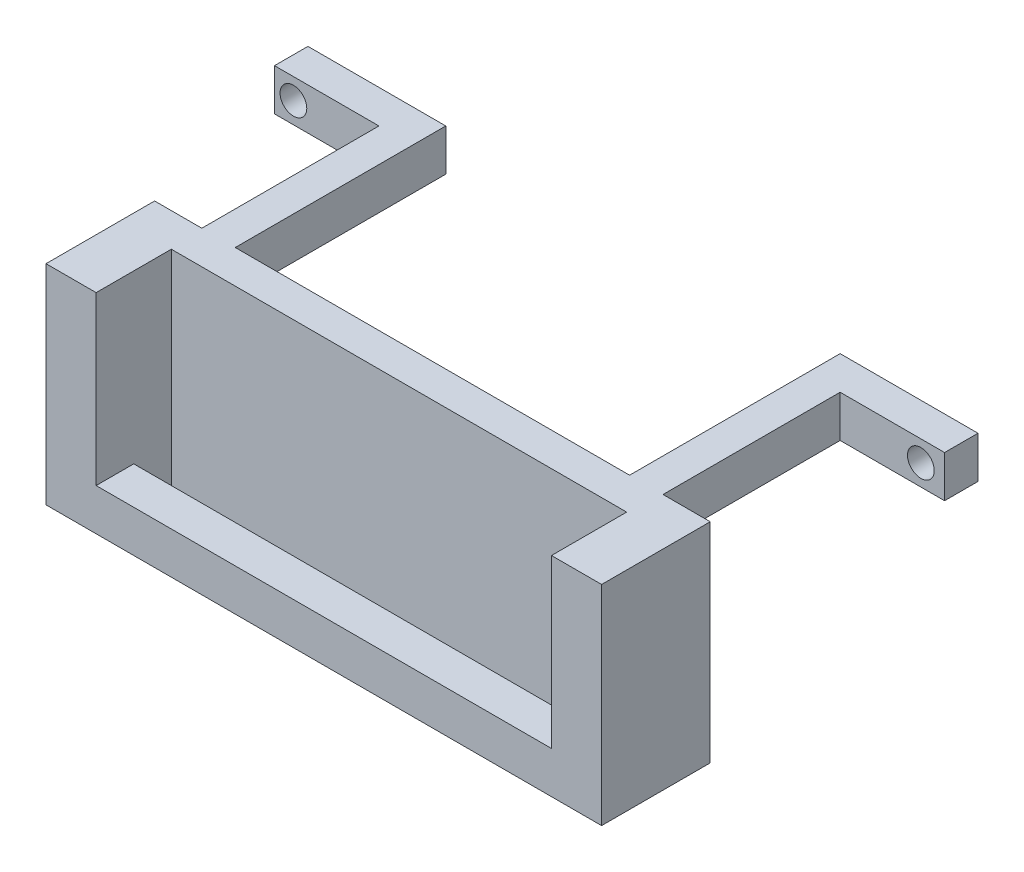
ISO-10303-21;
HEADER;
FILE_DESCRIPTION(('STEP AP214'),'2;1');
FILE_NAME('part.step','',(''),(''),'','','');
FILE_SCHEMA(('AUTOMOTIVE_DESIGN { 1 0 10303 214 1 1 1 1 }'));
ENDSEC;
DATA;
#1=APPLICATION_CONTEXT('core data for automotive mechanical design processes');
#2=APPLICATION_PROTOCOL_DEFINITION('international standard','automotive_design',2000,#1);
#3=PRODUCT_CONTEXT('',#1,'mechanical');
#4=PRODUCT('Part','Part','',(#3));
#5=PRODUCT_RELATED_PRODUCT_CATEGORY('part','',(#4));
#6=PRODUCT_DEFINITION_FORMATION('','',#4);
#7=PRODUCT_DEFINITION_CONTEXT('part definition',#1,'design');
#8=PRODUCT_DEFINITION('design','',#6,#7);
#9=PRODUCT_DEFINITION_SHAPE('','',#8);
#10=(LENGTH_UNIT() NAMED_UNIT(*) SI_UNIT(.MILLI.,.METRE.));
#11=(NAMED_UNIT(*) PLANE_ANGLE_UNIT() SI_UNIT($,.RADIAN.));
#12=(NAMED_UNIT(*) SI_UNIT($,.STERADIAN.) SOLID_ANGLE_UNIT());
#13=UNCERTAINTY_MEASURE_WITH_UNIT(LENGTH_MEASURE(1.E-05),#10,'distance_accuracy_value','');
#14=(GEOMETRIC_REPRESENTATION_CONTEXT(3) GLOBAL_UNCERTAINTY_ASSIGNED_CONTEXT((#13)) GLOBAL_UNIT_ASSIGNED_CONTEXT((#10,
#11,#12)) REPRESENTATION_CONTEXT('',''));
#15=CARTESIAN_POINT('',(0.,0.,0.));
#16=DIRECTION('',(0.,0.,1.));
#17=DIRECTION('',(1.,0.,0.));
#18=AXIS2_PLACEMENT_3D('',#15,#16,#17);
#19=CARTESIAN_POINT('',(-66.582634730539,-10.5311377245509,19.1));
#20=DIRECTION('',(0.,-1.,0.));
#21=DIRECTION('',(1.,0.,0.));
#22=AXIS2_PLACEMENT_3D('',#19,#20,#21);
#23=PLANE('',#22);
#24=DIRECTION('',(1.,0.,0.));
#25=VECTOR('',#24,1.);
#26=CARTESIAN_POINT('',(-94.8326347305389,-10.5311377245509,25.2));
#27=LINE('',#26,#25);
#28=CARTESIAN_POINT('',(-99.8326347305389,-10.5311377245509,25.2));
#29=VERTEX_POINT('',#28);
#30=CARTESIAN_POINT('',(-33.3326347305389,-10.5311377245509,25.2));
#31=VERTEX_POINT('',#30);
#32=EDGE_CURVE('E11',#29,#31,#27,.T.);
#33=ORIENTED_EDGE('',*,*,#32,.T.);
#34=DIRECTION('',(0.,0.,-1.));
#35=VECTOR('',#34,1.);
#36=CARTESIAN_POINT('',(-33.3326347305389,-10.5311377245509,38.2));
#37=LINE('',#36,#35);
#38=CARTESIAN_POINT('',(-33.3326347305389,-10.5311377245509,38.2));
#39=VERTEX_POINT('',#38);
#40=EDGE_CURVE('E24',#39,#31,#37,.T.);
#41=ORIENTED_EDGE('',*,*,#40,.F.);
#42=DIRECTION('',(1.,0.,0.));
#43=VECTOR('',#42,1.);
#44=CARTESIAN_POINT('',(-39.3326347305389,-10.5311377245509,38.2));
#45=LINE('',#44,#43);
#46=CARTESIAN_POINT('',(-99.8326347305389,-10.5311377245509,38.2));
#47=VERTEX_POINT('',#46);
#48=EDGE_CURVE('E452',#47,#39,#45,.T.);
#49=ORIENTED_EDGE('',*,*,#48,.F.);
#50=DIRECTION('',(0.,0.,1.));
#51=VECTOR('',#50,1.);
#52=CARTESIAN_POINT('',(-99.8326347305389,-10.5311377245509,25.2));
#53=LINE('',#52,#51);
#54=EDGE_CURVE('E449',#29,#47,#53,.T.);
#55=ORIENTED_EDGE('',*,*,#54,.F.);
#56=EDGE_LOOP('',(#33,#41,#49,#55));
#57=FACE_BOUND('',#56,.T.);
#58=DIRECTION('',(0.,0.,-1.));
#59=VECTOR('',#58,1.);
#60=CARTESIAN_POINT('',(-93.8326347305389,-10.5311377245509,19.1));
#61=LINE('',#60,#59);
#62=CARTESIAN_POINT('',(-93.8326347305389,-10.5311377245509,33.7));
#63=VERTEX_POINT('',#62);
#64=CARTESIAN_POINT('',(-93.8326347305389,-10.5311377245509,29.2));
#65=VERTEX_POINT('',#64);
#66=EDGE_CURVE('E446',#63,#65,#61,.T.);
#67=ORIENTED_EDGE('',*,*,#66,.F.);
#68=DIRECTION('',(1.,0.,0.));
#69=VECTOR('',#68,1.);
#70=CARTESIAN_POINT('',(-66.582634730539,-10.5311377245509,33.7));
#71=LINE('',#70,#69);
#72=CARTESIAN_POINT('',(-39.3326347305389,-10.5311377245509,33.7));
#73=VERTEX_POINT('',#72);
#74=EDGE_CURVE('E444',#63,#73,#71,.T.);
#75=ORIENTED_EDGE('',*,*,#74,.T.);
#76=DIRECTION('',(0.,0.,1.));
#77=VECTOR('',#76,1.);
#78=CARTESIAN_POINT('',(-39.3326347305389,-10.5311377245509,19.1));
#79=LINE('',#78,#77);
#80=CARTESIAN_POINT('',(-39.3326347305389,-10.5311377245509,29.2));
#81=VERTEX_POINT('',#80);
#82=EDGE_CURVE('E441',#81,#73,#79,.T.);
#83=ORIENTED_EDGE('',*,*,#82,.F.);
#84=DIRECTION('',(-1.,0.,0.));
#85=VECTOR('',#84,1.);
#86=CARTESIAN_POINT('',(-66.582634730539,-10.5311377245509,29.2));
#87=LINE('',#86,#85);
#88=EDGE_CURVE('E439',#81,#65,#87,.T.);
#89=ORIENTED_EDGE('',*,*,#88,.T.);
#90=EDGE_LOOP('',(#67,#75,#83,#89));
#91=FACE_BOUND('',#90,.T.);
#92=ADVANCED_FACE('F17',(#57,#91),#23,.T.);
#93=CARTESIAN_POINT('',(-39.3326347305389,14.4688622754491,35.2));
#94=DIRECTION('',(1.,0.,0.));
#95=DIRECTION('',(0.,0.,-1.));
#96=AXIS2_PLACEMENT_3D('',#93,#94,#95);
#97=PLANE('',#96);
#98=DIRECTION('',(0.,0.,-1.));
#99=VECTOR('',#98,1.);
#100=CARTESIAN_POINT('',(-39.3326347305389,-5.53113772455093,35.2));
#101=LINE('',#100,#99);
#102=CARTESIAN_POINT('',(-39.3326347305389,-5.53113772455093,38.2));
#103=VERTEX_POINT('',#102);
#104=CARTESIAN_POINT('',(-39.3326347305389,-5.53113772455093,33.7));
#105=VERTEX_POINT('',#104);
#106=EDGE_CURVE('E436',#103,#105,#101,.T.);
#107=ORIENTED_EDGE('',*,*,#106,.F.);
#108=DIRECTION('',(0.,-1.,0.));
#109=VECTOR('',#108,1.);
#110=CARTESIAN_POINT('',(-39.3326347305389,14.4688622754491,38.2));
#111=LINE('',#110,#109);
#112=CARTESIAN_POINT('',(-39.3326347305389,14.4688622754491,38.2));
#113=VERTEX_POINT('',#112);
#114=EDGE_CURVE('E433',#113,#103,#111,.T.);
#115=ORIENTED_EDGE('',*,*,#114,.F.);
#116=DIRECTION('',(0.,0.,-1.));
#117=VECTOR('',#116,1.);
#118=CARTESIAN_POINT('',(-39.3326347305389,14.4688622754491,35.2));
#119=LINE('',#118,#117);
#120=CARTESIAN_POINT('',(-39.3326347305389,14.4688622754491,29.2));
#121=VERTEX_POINT('',#120);
#122=EDGE_CURVE('E431',#113,#121,#119,.T.);
#123=ORIENTED_EDGE('',*,*,#122,.T.);
#124=DIRECTION('',(0.,1.,0.));
#125=VECTOR('',#124,1.);
#126=CARTESIAN_POINT('',(-39.3326347305389,14.4688622754491,29.2));
#127=LINE('',#126,#125);
#128=EDGE_CURVE('E428',#81,#121,#127,.T.);
#129=ORIENTED_EDGE('',*,*,#128,.F.);
#130=ORIENTED_EDGE('',*,*,#82,.T.);
#131=DIRECTION('',(0.,1.,0.));
#132=VECTOR('',#131,1.);
#133=CARTESIAN_POINT('',(-39.3326347305389,-30.531137724551,33.7));
#134=LINE('',#133,#132);
#135=EDGE_CURVE('E426',#73,#105,#134,.T.);
#136=ORIENTED_EDGE('',*,*,#135,.T.);
#137=EDGE_LOOP('',(#107,#115,#123,#129,#130,#136));
#138=FACE_BOUND('',#137,.T.);
#139=ADVANCED_FACE('F515',(#138),#97,.F.);
#140=CARTESIAN_POINT('',(-93.8326347305389,14.4688622754491,35.2));
#141=DIRECTION('',(-1.,0.,0.));
#142=DIRECTION('',(0.,0.,1.));
#143=AXIS2_PLACEMENT_3D('',#140,#141,#142);
#144=PLANE('',#143);
#145=DIRECTION('',(0.,0.,1.));
#146=VECTOR('',#145,1.);
#147=CARTESIAN_POINT('',(-93.8326347305389,-5.53113772455093,35.2));
#148=LINE('',#147,#146);
#149=CARTESIAN_POINT('',(-93.8326347305389,-5.53113772455093,33.7));
#150=VERTEX_POINT('',#149);
#151=CARTESIAN_POINT('',(-93.8326347305389,-5.53113772455093,38.2));
#152=VERTEX_POINT('',#151);
#153=EDGE_CURVE('E423',#150,#152,#148,.T.);
#154=ORIENTED_EDGE('',*,*,#153,.F.);
#155=DIRECTION('',(0.,1.,0.));
#156=VECTOR('',#155,1.);
#157=CARTESIAN_POINT('',(-93.8326347305389,-30.531137724551,33.7));
#158=LINE('',#157,#156);
#159=EDGE_CURVE('E420',#63,#150,#158,.T.);
#160=ORIENTED_EDGE('',*,*,#159,.F.);
#161=ORIENTED_EDGE('',*,*,#66,.T.);
#162=DIRECTION('',(0.,-1.,0.));
#163=VECTOR('',#162,1.);
#164=CARTESIAN_POINT('',(-93.8326347305389,14.4688622754491,29.2));
#165=LINE('',#164,#163);
#166=CARTESIAN_POINT('',(-93.8326347305389,14.4688622754491,29.2));
#167=VERTEX_POINT('',#166);
#168=EDGE_CURVE('E417',#167,#65,#165,.T.);
#169=ORIENTED_EDGE('',*,*,#168,.F.);
#170=DIRECTION('',(0.,0.,-1.));
#171=VECTOR('',#170,1.);
#172=CARTESIAN_POINT('',(-93.8326347305389,14.4688622754491,35.2));
#173=LINE('',#172,#171);
#174=CARTESIAN_POINT('',(-93.8326347305389,14.4688622754491,38.2));
#175=VERTEX_POINT('',#174);
#176=EDGE_CURVE('E414',#175,#167,#173,.T.);
#177=ORIENTED_EDGE('',*,*,#176,.F.);
#178=DIRECTION('',(0.,1.,0.));
#179=VECTOR('',#178,1.);
#180=CARTESIAN_POINT('',(-93.8326347305389,14.4688622754491,38.2));
#181=LINE('',#180,#179);
#182=EDGE_CURVE('E411',#152,#175,#181,.T.);
#183=ORIENTED_EDGE('',*,*,#182,.F.);
#184=EDGE_LOOP('',(#154,#160,#161,#169,#177,#183));
#185=FACE_BOUND('',#184,.T.);
#186=ADVANCED_FACE('F521',(#185),#144,.F.);
#187=CARTESIAN_POINT('',(0.,0.,29.2));
#188=DIRECTION('',(0.,0.,1.));
#189=DIRECTION('',(1.,0.,0.));
#190=AXIS2_PLACEMENT_3D('',#187,#188,#189);
#191=PLANE('',#190);
#192=ORIENTED_EDGE('',*,*,#168,.T.);
#193=ORIENTED_EDGE('',*,*,#88,.F.);
#194=ORIENTED_EDGE('',*,*,#128,.T.);
#195=DIRECTION('',(-1.,0.,0.));
#196=VECTOR('',#195,1.);
#197=CARTESIAN_POINT('',(-93.8326347305389,14.4688622754491,29.2));
#198=LINE('',#197,#196);
#199=EDGE_CURVE('E406',#121,#167,#198,.T.);
#200=ORIENTED_EDGE('',*,*,#199,.T.);
#201=EDGE_LOOP('',(#192,#193,#194,#200));
#202=FACE_BOUND('',#201,.T.);
#203=ADVANCED_FACE('F518',(#202),#191,.T.);
#204=CARTESIAN_POINT('',(-91.6826347305389,9.46886227544907,26.2));
#205=DIRECTION('',(0.,1.,0.));
#206=DIRECTION('',(0.,0.,1.));
#207=AXIS2_PLACEMENT_3D('',#204,#205,#206);
#208=PLANE('',#207);
#209=DIRECTION('',(0.,0.,-1.));
#210=VECTOR('',#209,1.);
#211=CARTESIAN_POINT('',(-38.9826347305389,9.46886227544905,25.2));
#212=LINE('',#211,#210);
#213=CARTESIAN_POINT('',(-38.9826347305389,9.46886227544907,25.2));
#214=VERTEX_POINT('',#213);
#215=CARTESIAN_POINT('',(-38.9826347305389,9.46886227544905,4.));
#216=VERTEX_POINT('',#215);
#217=EDGE_CURVE('E401',#214,#216,#212,.T.);
#218=ORIENTED_EDGE('',*,*,#217,.F.);
#219=DIRECTION('',(1.,0.,0.));
#220=VECTOR('',#219,1.);
#221=CARTESIAN_POINT('',(-94.8326347305389,9.46886227544907,25.2));
#222=LINE('',#221,#220);
#223=CARTESIAN_POINT('',(-42.9826347305389,9.46886227544907,25.2));
#224=VERTEX_POINT('',#223);
#225=EDGE_CURVE('E396',#224,#214,#222,.T.);
#226=ORIENTED_EDGE('',*,*,#225,.F.);
#227=DIRECTION('',(0.,0.,1.));
#228=VECTOR('',#227,1.);
#229=CARTESIAN_POINT('',(-42.9826347305389,9.46886227544907,0.));
#230=LINE('',#229,#228);
#231=CARTESIAN_POINT('',(-42.9826347305389,9.46886227544907,0.));
#232=VERTEX_POINT('',#231);
#233=EDGE_CURVE('E393',#232,#224,#230,.T.);
#234=ORIENTED_EDGE('',*,*,#233,.F.);
#235=DIRECTION('',(1.,0.,0.));
#236=VECTOR('',#235,1.);
#237=CARTESIAN_POINT('',(-91.6826347305389,9.46886227544907,0.));
#238=LINE('',#237,#236);
#239=CARTESIAN_POINT('',(-26.4826347305389,9.46886227544905,0.));
#240=VERTEX_POINT('',#239);
#241=EDGE_CURVE('E390',#232,#240,#238,.T.);
#242=ORIENTED_EDGE('',*,*,#241,.T.);
#243=DIRECTION('',(0.,0.,-1.));
#244=VECTOR('',#243,1.);
#245=CARTESIAN_POINT('',(-26.4826347305389,9.46886227544905,2.));
#246=LINE('',#245,#244);
#247=CARTESIAN_POINT('',(-26.4826347305389,9.46886227544905,4.));
#248=VERTEX_POINT('',#247);
#249=EDGE_CURVE('E387',#248,#240,#246,.T.);
#250=ORIENTED_EDGE('',*,*,#249,.F.);
#251=DIRECTION('',(1.,0.,0.));
#252=VECTOR('',#251,1.);
#253=CARTESIAN_POINT('',(-39.9826347305389,9.46886227544905,4.));
#254=LINE('',#253,#252);
#255=EDGE_CURVE('E384',#216,#248,#254,.T.);
#256=ORIENTED_EDGE('',*,*,#255,.F.);
#257=EDGE_LOOP('',(#218,#226,#234,#242,#250,#256));
#258=FACE_BOUND('',#257,.T.);
#259=ADVANCED_FACE('F494',(#258),#208,.F.);
#260=CARTESIAN_POINT('',(0.,0.,0.));
#261=DIRECTION('',(0.,0.,1.));
#262=DIRECTION('',(1.,0.,0.));
#263=AXIS2_PLACEMENT_3D('',#260,#261,#262);
#264=PLANE('',#263);
#265=CARTESIAN_POINT('',(-29.3190241396104,11.9688622754491,0.));
#266=DIRECTION('',(0.,0.,1.));
#267=DIRECTION('',(1.,0.,0.));
#268=AXIS2_PLACEMENT_3D('',#265,#266,#267);
#269=CIRCLE('',#268,1.6);
#270=CARTESIAN_POINT('',(-27.7190241396104,11.9688622754491,0.));
#271=VERTEX_POINT('',#270);
#272=EDGE_CURVE('E381',#271,#271,#269,.T.);
#273=ORIENTED_EDGE('',*,*,#272,.T.);
#274=EDGE_LOOP('',(#273));
#275=FACE_BOUND('',#274,.T.);
#276=DIRECTION('',(0.,-1.,0.));
#277=VECTOR('',#276,1.);
#278=CARTESIAN_POINT('',(-42.9826347305389,14.4688622754491,0.));
#279=LINE('',#278,#277);
#280=CARTESIAN_POINT('',(-42.9826347305389,14.4688622754491,0.));
#281=VERTEX_POINT('',#280);
#282=EDGE_CURVE('E378',#281,#232,#279,.T.);
#283=ORIENTED_EDGE('',*,*,#282,.F.);
#284=DIRECTION('',(-1.,0.,0.));
#285=VECTOR('',#284,1.);
#286=CARTESIAN_POINT('',(-91.6826347305389,14.4688622754491,0.));
#287=LINE('',#286,#285);
#288=CARTESIAN_POINT('',(-26.4826347305389,14.4688622754491,0.));
#289=VERTEX_POINT('',#288);
#290=EDGE_CURVE('E375',#289,#281,#287,.T.);
#291=ORIENTED_EDGE('',*,*,#290,.F.);
#292=DIRECTION('',(0.,1.,0.));
#293=VECTOR('',#292,1.);
#294=CARTESIAN_POINT('',(-26.4826347305389,14.4688622754491,0.));
#295=LINE('',#294,#293);
#296=EDGE_CURVE('E372',#240,#289,#295,.T.);
#297=ORIENTED_EDGE('',*,*,#296,.F.);
#298=ORIENTED_EDGE('',*,*,#241,.F.);
#299=EDGE_LOOP('',(#283,#291,#297,#298));
#300=FACE_BOUND('',#299,.T.);
#301=ADVANCED_FACE('F497',(#275,#300),#264,.F.);
#302=CARTESIAN_POINT('',(-96.6826347305389,14.4688622754491,2.));
#303=DIRECTION('',(0.,-1.,0.));
#304=DIRECTION('',(0.,0.,-1.));
#305=AXIS2_PLACEMENT_3D('',#302,#303,#304);
#306=PLANE('',#305);
#307=DIRECTION('',(-1.,0.,0.));
#308=VECTOR('',#307,1.);
#309=CARTESIAN_POINT('',(-38.3326347305389,14.4688622754491,25.2));
#310=LINE('',#309,#308);
#311=CARTESIAN_POINT('',(-33.3326347305389,14.4688622754491,25.2));
#312=VERTEX_POINT('',#311);
#313=CARTESIAN_POINT('',(-38.9826347305389,14.4688622754491,25.2));
#314=VERTEX_POINT('',#313);
#315=EDGE_CURVE('E370',#312,#314,#310,.T.);
#316=ORIENTED_EDGE('',*,*,#315,.T.);
#317=DIRECTION('',(0.,0.,1.));
#318=VECTOR('',#317,1.);
#319=CARTESIAN_POINT('',(-38.9826347305389,14.4688622754491,25.2));
#320=LINE('',#319,#318);
#321=CARTESIAN_POINT('',(-38.9826347305389,14.4688622754491,4.));
#322=VERTEX_POINT('',#321);
#323=EDGE_CURVE('E367',#322,#314,#320,.T.);
#324=ORIENTED_EDGE('',*,*,#323,.F.);
#325=DIRECTION('',(-1.,0.,0.));
#326=VECTOR('',#325,1.);
#327=CARTESIAN_POINT('',(-39.9826347305389,14.4688622754491,4.));
#328=LINE('',#327,#326);
#329=CARTESIAN_POINT('',(-26.4826347305389,14.4688622754491,4.));
#330=VERTEX_POINT('',#329);
#331=EDGE_CURVE('E364',#330,#322,#328,.T.);
#332=ORIENTED_EDGE('',*,*,#331,.F.);
#333=DIRECTION('',(0.,0.,1.));
#334=VECTOR('',#333,1.);
#335=CARTESIAN_POINT('',(-26.4826347305389,14.4688622754491,2.));
#336=LINE('',#335,#334);
#337=EDGE_CURVE('E361',#289,#330,#336,.T.);
#338=ORIENTED_EDGE('',*,*,#337,.F.);
#339=ORIENTED_EDGE('',*,*,#290,.T.);
#340=DIRECTION('',(0.,0.,-1.));
#341=VECTOR('',#340,1.);
#342=CARTESIAN_POINT('',(-42.9826347305389,14.4688622754491,0.));
#343=LINE('',#342,#341);
#344=CARTESIAN_POINT('',(-42.9826347305389,14.4688622754491,25.1997835267334));
#345=VERTEX_POINT('',#344);
#346=EDGE_CURVE('E358',#345,#281,#343,.T.);
#347=ORIENTED_EDGE('',*,*,#346,.F.);
#348=DIRECTION('',(-1.,0.,0.));
#349=VECTOR('',#348,1.);
#350=CARTESIAN_POINT('',(-91.6826347305389,14.4688622754491,25.1997835267334));
#351=LINE('',#350,#349);
#352=CARTESIAN_POINT('',(-90.1826347305389,14.4688622754491,25.1997835267334));
#353=VERTEX_POINT('',#352);
#354=EDGE_CURVE('E356',#345,#353,#351,.T.);
#355=ORIENTED_EDGE('',*,*,#354,.T.);
#356=DIRECTION('',(0.,0.,1.));
#357=VECTOR('',#356,1.);
#358=CARTESIAN_POINT('',(-90.1826347305389,14.4688622754491,25.1997835267334));
#359=LINE('',#358,#357);
#360=CARTESIAN_POINT('',(-90.1826347305389,14.4688622754491,0.));
#361=VERTEX_POINT('',#360);
#362=EDGE_CURVE('E353',#361,#353,#359,.T.);
#363=ORIENTED_EDGE('',*,*,#362,.F.);
#364=DIRECTION('',(1.,0.,0.));
#365=VECTOR('',#364,1.);
#366=CARTESIAN_POINT('',(-96.6826347305389,14.4688622754491,0.));
#367=LINE('',#366,#365);
#368=CARTESIAN_POINT('',(-106.682634730539,14.4688622754491,0.));
#369=VERTEX_POINT('',#368);
#370=EDGE_CURVE('E350',#369,#361,#367,.T.);
#371=ORIENTED_EDGE('',*,*,#370,.F.);
#372=DIRECTION('',(0.,0.,-1.));
#373=VECTOR('',#372,1.);
#374=CARTESIAN_POINT('',(-106.682634730539,14.4688622754491,0.));
#375=LINE('',#374,#373);
#376=CARTESIAN_POINT('',(-106.682634730539,14.4688622754491,4.));
#377=VERTEX_POINT('',#376);
#378=EDGE_CURVE('E347',#377,#369,#375,.T.);
#379=ORIENTED_EDGE('',*,*,#378,.F.);
#380=DIRECTION('',(-1.,0.,0.));
#381=VECTOR('',#380,1.);
#382=CARTESIAN_POINT('',(-106.682634730539,14.4688622754491,4.));
#383=LINE('',#382,#381);
#384=CARTESIAN_POINT('',(-94.1826347305389,14.4688622754491,4.));
#385=VERTEX_POINT('',#384);
#386=EDGE_CURVE('E345',#385,#377,#383,.T.);
#387=ORIENTED_EDGE('',*,*,#386,.F.);
#388=DIRECTION('',(0.,0.,-1.));
#389=VECTOR('',#388,1.);
#390=CARTESIAN_POINT('',(-94.1826347305389,14.4688622754491,4.));
#391=LINE('',#390,#389);
#392=CARTESIAN_POINT('',(-94.1826347305389,14.4688622754491,25.2));
#393=VERTEX_POINT('',#392);
#394=EDGE_CURVE('E204',#393,#385,#391,.T.);
#395=ORIENTED_EDGE('',*,*,#394,.F.);
#396=DIRECTION('',(1.,0.,0.));
#397=VECTOR('',#396,1.);
#398=CARTESIAN_POINT('',(-94.8326347305389,14.4688622754491,25.2));
#399=LINE('',#398,#397);
#400=CARTESIAN_POINT('',(-99.8326347305389,14.4688622754491,25.2));
#401=VERTEX_POINT('',#400);
#402=EDGE_CURVE('E341',#401,#393,#399,.T.);
#403=ORIENTED_EDGE('',*,*,#402,.F.);
#404=DIRECTION('',(0.,0.,-1.));
#405=VECTOR('',#404,1.);
#406=CARTESIAN_POINT('',(-99.8326347305389,14.4688622754491,25.2));
#407=LINE('',#406,#405);
#408=CARTESIAN_POINT('',(-99.8326347305389,14.4688622754491,38.2));
#409=VERTEX_POINT('',#408);
#410=EDGE_CURVE('E338',#409,#401,#407,.T.);
#411=ORIENTED_EDGE('',*,*,#410,.F.);
#412=DIRECTION('',(-1.,0.,0.));
#413=VECTOR('',#412,1.);
#414=CARTESIAN_POINT('',(-96.8326347305389,14.4688622754491,38.2));
#415=LINE('',#414,#413);
#416=EDGE_CURVE('E335',#175,#409,#415,.T.);
#417=ORIENTED_EDGE('',*,*,#416,.F.);
#418=ORIENTED_EDGE('',*,*,#176,.T.);
#419=ORIENTED_EDGE('',*,*,#199,.F.);
#420=ORIENTED_EDGE('',*,*,#122,.F.);
#421=DIRECTION('',(-1.,0.,0.));
#422=VECTOR('',#421,1.);
#423=CARTESIAN_POINT('',(-39.3326347305389,14.4688622754491,38.2));
#424=LINE('',#423,#422);
#425=CARTESIAN_POINT('',(-33.3326347305389,14.4688622754491,38.2));
#426=VERTEX_POINT('',#425);
#427=EDGE_CURVE('E332',#426,#113,#424,.T.);
#428=ORIENTED_EDGE('',*,*,#427,.F.);
#429=DIRECTION('',(0.,0.,1.));
#430=VECTOR('',#429,1.);
#431=CARTESIAN_POINT('',(-33.3326347305389,14.4688622754491,38.2));
#432=LINE('',#431,#430);
#433=EDGE_CURVE('E329',#312,#426,#432,.T.);
#434=ORIENTED_EDGE('',*,*,#433,.F.);
#435=EDGE_LOOP('',(#316,#324,#332,#338,#339,#347,#355,#363,#371,#379,#387,#395,#403,#411,#417,
#418,#419,#420,#428,#434));
#436=FACE_BOUND('',#435,.T.);
#437=ADVANCED_FACE('F473',(#436),#306,.F.);
#438=CARTESIAN_POINT('',(-96.6826347305389,14.4688622754491,0.));
#439=DIRECTION('',(0.,0.,1.));
#440=DIRECTION('',(1.,0.,0.));
#441=AXIS2_PLACEMENT_3D('',#438,#439,#440);
#442=PLANE('',#441);
#443=CARTESIAN_POINT('',(-104.419830921664,11.9688622754491,0.));
#444=DIRECTION('',(0.,0.,1.));
#445=DIRECTION('',(1.,0.,0.));
#446=AXIS2_PLACEMENT_3D('',#443,#444,#445);
#447=CIRCLE('',#446,1.6);
#448=CARTESIAN_POINT('',(-102.819830921664,11.9688622754491,0.));
#449=VERTEX_POINT('',#448);
#450=EDGE_CURVE('E326',#449,#449,#447,.T.);
#451=ORIENTED_EDGE('',*,*,#450,.T.);
#452=EDGE_LOOP('',(#451));
#453=FACE_BOUND('',#452,.T.);
#454=ORIENTED_EDGE('',*,*,#370,.T.);
#455=DIRECTION('',(0.,1.,0.));
#456=VECTOR('',#455,1.);
#457=CARTESIAN_POINT('',(-90.1826347305389,9.46886227544907,0.));
#458=LINE('',#457,#456);
#459=CARTESIAN_POINT('',(-90.1826347305389,9.46886227544907,0.));
#460=VERTEX_POINT('',#459);
#461=EDGE_CURVE('E323',#460,#361,#458,.T.);
#462=ORIENTED_EDGE('',*,*,#461,.F.);
#463=CARTESIAN_POINT('',(-94.6826347305389,9.46886227544907,0.));
#464=VERTEX_POINT('',#463);
#465=EDGE_CURVE('E322',#464,#460,#238,.T.);
#466=ORIENTED_EDGE('',*,*,#465,.F.);
#467=DIRECTION('',(0.,-1.,0.));
#468=VECTOR('',#467,1.);
#469=CARTESIAN_POINT('',(-94.6826347305389,14.4688622754491,0.));
#470=LINE('',#469,#468);
#471=CARTESIAN_POINT('',(-94.6826347305389,9.47157193083374,0.));
#472=VERTEX_POINT('',#471);
#473=EDGE_CURVE('E319',#472,#464,#470,.T.);
#474=ORIENTED_EDGE('',*,*,#473,.F.);
#475=DIRECTION('',(1.,0.,0.));
#476=VECTOR('',#475,1.);
#477=CARTESIAN_POINT('',(-96.6826347305389,9.47157193083374,0.));
#478=LINE('',#477,#476);
#479=CARTESIAN_POINT('',(-106.682634730539,9.47157193083374,0.));
#480=VERTEX_POINT('',#479);
#481=EDGE_CURVE('E316',#480,#472,#478,.T.);
#482=ORIENTED_EDGE('',*,*,#481,.F.);
#483=DIRECTION('',(0.,-1.,0.));
#484=VECTOR('',#483,1.);
#485=CARTESIAN_POINT('',(-106.682634730539,14.4688622754491,0.));
#486=LINE('',#485,#484);
#487=EDGE_CURVE('E313',#369,#480,#486,.T.);
#488=ORIENTED_EDGE('',*,*,#487,.F.);
#489=EDGE_LOOP('',(#454,#462,#466,#474,#482,#488));
#490=FACE_BOUND('',#489,.T.);
#491=ADVANCED_FACE('F568',(#453,#490),#442,.F.);
#492=CARTESIAN_POINT('',(-96.6826347305389,9.47157193083374,2.));
#493=DIRECTION('',(0.,1.,0.));
#494=DIRECTION('',(0.,0.,1.));
#495=AXIS2_PLACEMENT_3D('',#492,#493,#494);
#496=PLANE('',#495);
#497=DIRECTION('',(0.,0.,1.));
#498=VECTOR('',#497,1.);
#499=CARTESIAN_POINT('',(-94.6826347305389,9.47157193083374,2.));
#500=LINE('',#499,#498);
#501=CARTESIAN_POINT('',(-94.6826347305389,9.47157193083374,2.));
#502=VERTEX_POINT('',#501);
#503=EDGE_CURVE('E311',#472,#502,#500,.T.);
#504=ORIENTED_EDGE('',*,*,#503,.T.);
#505=DIRECTION('',(1.,0.,0.));
#506=VECTOR('',#505,1.);
#507=CARTESIAN_POINT('',(-96.6826347305389,9.47157193083374,2.));
#508=LINE('',#507,#506);
#509=CARTESIAN_POINT('',(-106.682634730539,9.47157193083374,2.));
#510=VERTEX_POINT('',#509);
#511=EDGE_CURVE('E308',#510,#502,#508,.T.);
#512=ORIENTED_EDGE('',*,*,#511,.F.);
#513=DIRECTION('',(0.,0.,1.));
#514=VECTOR('',#513,1.);
#515=CARTESIAN_POINT('',(-106.682634730539,9.47157193083374,0.));
#516=LINE('',#515,#514);
#517=EDGE_CURVE('E305',#480,#510,#516,.T.);
#518=ORIENTED_EDGE('',*,*,#517,.F.);
#519=ORIENTED_EDGE('',*,*,#481,.T.);
#520=EDGE_LOOP('',(#504,#512,#518,#519));
#521=FACE_BOUND('',#520,.T.);
#522=ADVANCED_FACE('F571',(#521),#496,.F.);
#523=CARTESIAN_POINT('',(-106.682634730539,0.,0.));
#524=DIRECTION('',(-1.,0.,0.));
#525=DIRECTION('',(0.,0.,1.));
#526=AXIS2_PLACEMENT_3D('',#523,#524,#525);
#527=PLANE('',#526);
#528=ORIENTED_EDGE('',*,*,#487,.T.);
#529=ORIENTED_EDGE('',*,*,#517,.T.);
#530=DIRECTION('',(0.,-1.,0.));
#531=VECTOR('',#530,1.);
#532=CARTESIAN_POINT('',(-106.682634730539,14.4688622754491,2.));
#533=LINE('',#532,#531);
#534=CARTESIAN_POINT('',(-106.682634730539,9.46886227544907,2.));
#535=VERTEX_POINT('',#534);
#536=EDGE_CURVE('E303',#510,#535,#533,.T.);
#537=ORIENTED_EDGE('',*,*,#536,.T.);
#538=DIRECTION('',(0.,0.,-1.));
#539=VECTOR('',#538,1.);
#540=CARTESIAN_POINT('',(-106.682634730539,9.46886227544907,4.));
#541=LINE('',#540,#539);
#542=CARTESIAN_POINT('',(-106.682634730539,9.46886227544907,4.));
#543=VERTEX_POINT('',#542);
#544=EDGE_CURVE('E301',#543,#535,#541,.T.);
#545=ORIENTED_EDGE('',*,*,#544,.F.);
#546=DIRECTION('',(0.,-1.,0.));
#547=VECTOR('',#546,1.);
#548=CARTESIAN_POINT('',(-106.682634730539,14.4688622754491,4.));
#549=LINE('',#548,#547);
#550=EDGE_CURVE('E200',#377,#543,#549,.T.);
#551=ORIENTED_EDGE('',*,*,#550,.F.);
#552=ORIENTED_EDGE('',*,*,#378,.T.);
#553=EDGE_LOOP('',(#528,#529,#537,#545,#551,#552));
#554=FACE_BOUND('',#553,.T.);
#555=ADVANCED_FACE('F477',(#554),#527,.T.);
#556=CARTESIAN_POINT('',(-94.6826347305389,0.,0.));
#557=DIRECTION('',(1.,0.,0.));
#558=DIRECTION('',(0.,0.,-1.));
#559=AXIS2_PLACEMENT_3D('',#556,#557,#558);
#560=PLANE('',#559);
#561=DIRECTION('',(0.,1.,0.));
#562=VECTOR('',#561,1.);
#563=CARTESIAN_POINT('',(-94.6826347305389,14.4688622754491,2.));
#564=LINE('',#563,#562);
#565=CARTESIAN_POINT('',(-94.6826347305389,9.46886227544907,2.));
#566=VERTEX_POINT('',#565);
#567=EDGE_CURVE('E297',#566,#502,#564,.T.);
#568=ORIENTED_EDGE('',*,*,#567,.T.);
#569=ORIENTED_EDGE('',*,*,#503,.F.);
#570=ORIENTED_EDGE('',*,*,#473,.T.);
#571=DIRECTION('',(0.,0.,1.));
#572=VECTOR('',#571,1.);
#573=CARTESIAN_POINT('',(-94.6826347305389,9.46886227544907,2.));
#574=LINE('',#573,#572);
#575=EDGE_CURVE('E293',#464,#566,#574,.T.);
#576=ORIENTED_EDGE('',*,*,#575,.T.);
#577=EDGE_LOOP('',(#568,#569,#570,#576));
#578=FACE_BOUND('',#577,.T.);
#579=ADVANCED_FACE('F259',(#578),#560,.F.);
#580=DIRECTION('',(0.,0.,-1.));
#581=VECTOR('',#580,1.);
#582=CARTESIAN_POINT('',(-90.1826347305389,9.46886227544907,25.1997835267334));
#583=LINE('',#582,#581);
#584=CARTESIAN_POINT('',(-90.1826347305389,9.46886227544907,25.2));
#585=VERTEX_POINT('',#584);
#586=EDGE_CURVE('E288',#585,#460,#583,.T.);
#587=ORIENTED_EDGE('',*,*,#586,.F.);
#588=DIRECTION('',(1.,0.,0.));
#589=VECTOR('',#588,1.);
#590=CARTESIAN_POINT('',(-94.8326347305389,9.46886227544907,25.2));
#591=LINE('',#590,#589);
#592=CARTESIAN_POINT('',(-94.1826347305389,9.46886227544907,25.2));
#593=VERTEX_POINT('',#592);
#594=EDGE_CURVE('E186',#593,#585,#591,.T.);
#595=ORIENTED_EDGE('',*,*,#594,.F.);
#596=DIRECTION('',(0.,0.,1.));
#597=VECTOR('',#596,1.);
#598=CARTESIAN_POINT('',(-94.1826347305389,9.46886227544907,4.));
#599=LINE('',#598,#597);
#600=CARTESIAN_POINT('',(-94.1826347305389,9.46886227544907,4.));
#601=VERTEX_POINT('',#600);
#602=EDGE_CURVE('E179',#601,#593,#599,.T.);
#603=ORIENTED_EDGE('',*,*,#602,.F.);
#604=DIRECTION('',(1.,0.,0.));
#605=VECTOR('',#604,1.);
#606=CARTESIAN_POINT('',(-106.682634730539,9.46886227544907,4.));
#607=LINE('',#606,#605);
#608=EDGE_CURVE('E183',#543,#601,#607,.T.);
#609=ORIENTED_EDGE('',*,*,#608,.F.);
#610=ORIENTED_EDGE('',*,*,#544,.T.);
#611=DIRECTION('',(1.,0.,0.));
#612=VECTOR('',#611,1.);
#613=CARTESIAN_POINT('',(-106.682634730539,9.46886227544907,2.));
#614=LINE('',#613,#612);
#615=EDGE_CURVE('E201',#535,#566,#614,.T.);
#616=ORIENTED_EDGE('',*,*,#615,.T.);
#617=ORIENTED_EDGE('',*,*,#575,.F.);
#618=ORIENTED_EDGE('',*,*,#465,.T.);
#619=EDGE_LOOP('',(#587,#595,#603,#609,#610,#616,#617,#618));
#620=FACE_BOUND('',#619,.T.);
#621=ADVANCED_FACE('F181',(#620),#208,.F.);
#622=CARTESIAN_POINT('',(-89.1826347305389,32.4688622754491,25.1997835267334));
#623=DIRECTION('',(0.,0.,1.));
#624=DIRECTION('',(1.,0.,0.));
#625=AXIS2_PLACEMENT_3D('',#622,#623,#624);
#626=PLANE('',#625);
#627=ORIENTED_EDGE('',*,*,#354,.F.);
#628=DIRECTION('',(0.,1.,0.));
#629=VECTOR('',#628,1.);
#630=CARTESIAN_POINT('',(-42.9826347305389,14.4688622754491,25.1997835267334));
#631=LINE('',#630,#629);
#632=EDGE_CURVE('E278',#224,#345,#631,.T.);
#633=ORIENTED_EDGE('',*,*,#632,.F.);
#634=CARTESIAN_POINT('',(-42.9826347305389,9.4688622754491,25.1997835267334));
#635=DIRECTION('',(-1.,0.,0.));
#636=VECTOR('',#635,1.);
#637=LINE('',#634,#636);
#638=EDGE_CURVE('E277',#224,#585,#637,.T.);
#639=ORIENTED_EDGE('',*,*,#638,.T.);
#640=DIRECTION('',(0.,-1.,0.));
#641=VECTOR('',#640,1.);
#642=CARTESIAN_POINT('',(-90.1826347305389,9.46886227544907,25.1997835267334));
#643=LINE('',#642,#641);
#644=EDGE_CURVE('E465',#353,#585,#643,.T.);
#645=ORIENTED_EDGE('',*,*,#644,.F.);
#646=EDGE_LOOP('',(#627,#633,#639,#645));
#647=FACE_BOUND('',#646,.T.);
#648=ADVANCED_FACE('F252',(#647),#626,.F.);
#649=CARTESIAN_POINT('',(-94.8326347305389,14.4688622754491,25.2));
#650=DIRECTION('',(0.,0.,1.));
#651=DIRECTION('',(0.,-1.,0.));
#652=AXIS2_PLACEMENT_3D('',#649,#650,#651);
#653=PLANE('',#652);
#654=ORIENTED_EDGE('',*,*,#32,.F.);
#655=DIRECTION('',(0.,-1.,0.));
#656=VECTOR('',#655,1.);
#657=CARTESIAN_POINT('',(-99.8326347305389,14.4688622754491,25.2));
#658=LINE('',#657,#656);
#659=EDGE_CURVE('E462',#401,#29,#658,.T.);
#660=ORIENTED_EDGE('',*,*,#659,.F.);
#661=ORIENTED_EDGE('',*,*,#402,.T.);
#662=DIRECTION('',(0.,1.,0.));
#663=VECTOR('',#662,1.);
#664=CARTESIAN_POINT('',(-94.1826347305389,14.4688622754491,25.2));
#665=LINE('',#664,#663);
#666=EDGE_CURVE('E232',#593,#393,#665,.T.);
#667=ORIENTED_EDGE('',*,*,#666,.F.);
#668=ORIENTED_EDGE('',*,*,#594,.T.);
#669=ORIENTED_EDGE('',*,*,#638,.F.);
#670=ORIENTED_EDGE('',*,*,#225,.T.);
#671=DIRECTION('',(0.,-1.,0.));
#672=VECTOR('',#671,1.);
#673=CARTESIAN_POINT('',(-38.9826347305389,14.4688622754491,25.2));
#674=LINE('',#673,#672);
#675=EDGE_CURVE('E227',#314,#214,#674,.T.);
#676=ORIENTED_EDGE('',*,*,#675,.F.);
#677=ORIENTED_EDGE('',*,*,#315,.F.);
#678=DIRECTION('',(0.,1.,0.));
#679=VECTOR('',#678,1.);
#680=CARTESIAN_POINT('',(-33.3326347305389,14.4688622754491,25.2));
#681=LINE('',#680,#679);
#682=EDGE_CURVE('E224',#31,#312,#681,.T.);
#683=ORIENTED_EDGE('',*,*,#682,.F.);
#684=EDGE_LOOP('',(#654,#660,#661,#667,#668,#669,#670,#676,#677,#683));
#685=FACE_BOUND('',#684,.T.);
#686=ADVANCED_FACE('F241',(#685),#653,.F.);
#687=CARTESIAN_POINT('',(0.,0.,38.2));
#688=DIRECTION('',(0.,0.,1.));
#689=DIRECTION('',(1.,0.,0.));
#690=AXIS2_PLACEMENT_3D('',#687,#688,#689);
#691=PLANE('',#690);
#692=ORIENTED_EDGE('',*,*,#48,.T.);
#693=DIRECTION('',(0.,-1.,0.));
#694=VECTOR('',#693,1.);
#695=CARTESIAN_POINT('',(-33.3326347305389,14.4688622754491,38.2));
#696=LINE('',#695,#694);
#697=EDGE_CURVE('E221',#426,#39,#696,.T.);
#698=ORIENTED_EDGE('',*,*,#697,.F.);
#699=ORIENTED_EDGE('',*,*,#427,.T.);
#700=ORIENTED_EDGE('',*,*,#114,.T.);
#701=DIRECTION('',(1.,0.,0.));
#702=VECTOR('',#701,1.);
#703=CARTESIAN_POINT('',(-39.3326347305389,-5.53113772455093,38.2));
#704=LINE('',#703,#702);
#705=EDGE_CURVE('E218',#152,#103,#704,.T.);
#706=ORIENTED_EDGE('',*,*,#705,.F.);
#707=ORIENTED_EDGE('',*,*,#182,.T.);
#708=ORIENTED_EDGE('',*,*,#416,.T.);
#709=DIRECTION('',(0.,1.,0.));
#710=VECTOR('',#709,1.);
#711=CARTESIAN_POINT('',(-99.8326347305389,14.4688622754491,38.2));
#712=LINE('',#711,#710);
#713=EDGE_CURVE('E209',#47,#409,#712,.T.);
#714=ORIENTED_EDGE('',*,*,#713,.F.);
#715=EDGE_LOOP('',(#692,#698,#699,#700,#706,#707,#708,#714));
#716=FACE_BOUND('',#715,.T.);
#717=ADVANCED_FACE('F251',(#716),#691,.T.);
#718=CARTESIAN_POINT('',(-99.8326347305389,0.,0.));
#719=DIRECTION('',(-1.,0.,0.));
#720=DIRECTION('',(0.,0.,1.));
#721=AXIS2_PLACEMENT_3D('',#718,#719,#720);
#722=PLANE('',#721);
#723=ORIENTED_EDGE('',*,*,#713,.T.);
#724=ORIENTED_EDGE('',*,*,#410,.T.);
#725=ORIENTED_EDGE('',*,*,#659,.T.);
#726=ORIENTED_EDGE('',*,*,#54,.T.);
#727=EDGE_LOOP('',(#723,#724,#725,#726));
#728=FACE_BOUND('',#727,.T.);
#729=ADVANCED_FACE('F464',(#728),#722,.T.);
#730=CARTESIAN_POINT('',(-33.3326347305389,0.,0.));
#731=DIRECTION('',(1.,0.,0.));
#732=DIRECTION('',(0.,0.,-1.));
#733=AXIS2_PLACEMENT_3D('',#730,#731,#732);
#734=PLANE('',#733);
#735=ORIENTED_EDGE('',*,*,#682,.T.);
#736=ORIENTED_EDGE('',*,*,#433,.T.);
#737=ORIENTED_EDGE('',*,*,#697,.T.);
#738=ORIENTED_EDGE('',*,*,#40,.T.);
#739=EDGE_LOOP('',(#735,#736,#737,#738));
#740=FACE_BOUND('',#739,.T.);
#741=ADVANCED_FACE('F454',(#740),#734,.T.);
#742=CARTESIAN_POINT('',(-26.4826347305389,0.,0.));
#743=DIRECTION('',(1.,0.,0.));
#744=DIRECTION('',(0.,1.,0.));
#745=AXIS2_PLACEMENT_3D('',#742,#743,#744);
#746=PLANE('',#745);
#747=ORIENTED_EDGE('',*,*,#337,.T.);
#748=DIRECTION('',(0.,1.,0.));
#749=VECTOR('',#748,1.);
#750=CARTESIAN_POINT('',(-26.4826347305389,14.4688622754491,4.));
#751=LINE('',#750,#749);
#752=EDGE_CURVE('E205',#248,#330,#751,.T.);
#753=ORIENTED_EDGE('',*,*,#752,.F.);
#754=ORIENTED_EDGE('',*,*,#249,.T.);
#755=ORIENTED_EDGE('',*,*,#296,.T.);
#756=EDGE_LOOP('',(#747,#753,#754,#755));
#757=FACE_BOUND('',#756,.T.);
#758=ADVANCED_FACE('F501',(#757),#746,.T.);
#759=CARTESIAN_POINT('',(0.,0.,2.));
#760=DIRECTION('',(0.,0.,1.));
#761=DIRECTION('',(1.,0.,0.));
#762=AXIS2_PLACEMENT_3D('',#759,#760,#761);
#763=PLANE('',#762);
#764=ORIENTED_EDGE('',*,*,#536,.F.);
#765=ORIENTED_EDGE('',*,*,#511,.T.);
#766=ORIENTED_EDGE('',*,*,#567,.F.);
#767=ORIENTED_EDGE('',*,*,#615,.F.);
#768=EDGE_LOOP('',(#764,#765,#766,#767));
#769=FACE_BOUND('',#768,.T.);
#770=ADVANCED_FACE('F483',(#769),#763,.F.);
#771=CARTESIAN_POINT('',(0.,0.,4.));
#772=DIRECTION('',(0.,0.,1.));
#773=DIRECTION('',(1.,0.,0.));
#774=AXIS2_PLACEMENT_3D('',#771,#772,#773);
#775=PLANE('',#774);
#776=DIRECTION('',(0.,-1.,0.));
#777=VECTOR('',#776,1.);
#778=CARTESIAN_POINT('',(-94.1826347305389,14.4688622754491,4.));
#779=LINE('',#778,#777);
#780=EDGE_CURVE('E197',#385,#601,#779,.T.);
#781=ORIENTED_EDGE('',*,*,#780,.F.);
#782=ORIENTED_EDGE('',*,*,#386,.T.);
#783=ORIENTED_EDGE('',*,*,#550,.T.);
#784=ORIENTED_EDGE('',*,*,#608,.T.);
#785=EDGE_LOOP('',(#781,#782,#783,#784));
#786=FACE_BOUND('',#785,.T.);
#787=CARTESIAN_POINT('',(-104.419830921664,11.9688622754491,4.));
#788=DIRECTION('',(0.,0.,1.));
#789=DIRECTION('',(1.,0.,0.));
#790=AXIS2_PLACEMENT_3D('',#787,#788,#789);
#791=CIRCLE('',#790,1.6);
#792=CARTESIAN_POINT('',(-102.819830921664,11.9688622754491,4.));
#793=VERTEX_POINT('',#792);
#794=EDGE_CURVE('E206',#793,#793,#791,.T.);
#795=ORIENTED_EDGE('',*,*,#794,.F.);
#796=EDGE_LOOP('',(#795));
#797=FACE_BOUND('',#796,.T.);
#798=ADVANCED_FACE('F194',(#786,#797),#775,.T.);
#799=CARTESIAN_POINT('',(0.,0.,4.));
#800=DIRECTION('',(0.,0.,1.));
#801=DIRECTION('',(1.,0.,0.));
#802=AXIS2_PLACEMENT_3D('',#799,#800,#801);
#803=PLANE('',#802);
#804=DIRECTION('',(0.,1.,0.));
#805=VECTOR('',#804,1.);
#806=CARTESIAN_POINT('',(-38.9826347305389,14.4688622754491,4.));
#807=LINE('',#806,#805);
#808=EDGE_CURVE('E212',#216,#322,#807,.T.);
#809=ORIENTED_EDGE('',*,*,#808,.F.);
#810=ORIENTED_EDGE('',*,*,#255,.T.);
#811=ORIENTED_EDGE('',*,*,#752,.T.);
#812=ORIENTED_EDGE('',*,*,#331,.T.);
#813=EDGE_LOOP('',(#809,#810,#811,#812));
#814=FACE_BOUND('',#813,.T.);
#815=CARTESIAN_POINT('',(-29.3190241396104,11.9688622754491,4.));
#816=DIRECTION('',(0.,0.,1.));
#817=DIRECTION('',(1.,0.,0.));
#818=AXIS2_PLACEMENT_3D('',#815,#816,#817);
#819=CIRCLE('',#818,1.6);
#820=CARTESIAN_POINT('',(-27.7190241396104,11.9688622754491,4.));
#821=VERTEX_POINT('',#820);
#822=EDGE_CURVE('E508',#821,#821,#819,.T.);
#823=ORIENTED_EDGE('',*,*,#822,.F.);
#824=EDGE_LOOP('',(#823));
#825=FACE_BOUND('',#824,.T.);
#826=ADVANCED_FACE('F505',(#814,#825),#803,.T.);
#827=CARTESIAN_POINT('',(-104.419830921664,11.9688622754491,-8.));
#828=DIRECTION('',(0.,0.,1.));
#829=DIRECTION('',(1.,0.,0.));
#830=AXIS2_PLACEMENT_3D('',#827,#828,#829);
#831=CYLINDRICAL_SURFACE('',#830,1.6);
#832=ORIENTED_EDGE('',*,*,#794,.T.);
#833=EDGE_LOOP('',(#832));
#834=FACE_BOUND('',#833,.T.);
#835=ORIENTED_EDGE('',*,*,#450,.F.);
#836=EDGE_LOOP('',(#835));
#837=FACE_BOUND('',#836,.T.);
#838=ADVANCED_FACE('F540',(#834,#837),#831,.F.);
#839=CARTESIAN_POINT('',(-29.3190241396104,11.9688622754491,-8.));
#840=DIRECTION('',(0.,0.,1.));
#841=DIRECTION('',(1.,0.,0.));
#842=AXIS2_PLACEMENT_3D('',#839,#840,#841);
#843=CYLINDRICAL_SURFACE('',#842,1.6);
#844=ORIENTED_EDGE('',*,*,#822,.T.);
#845=EDGE_LOOP('',(#844));
#846=FACE_BOUND('',#845,.T.);
#847=ORIENTED_EDGE('',*,*,#272,.F.);
#848=EDGE_LOOP('',(#847));
#849=FACE_BOUND('',#848,.T.);
#850=ADVANCED_FACE('F537',(#846,#849),#843,.F.);
#851=CARTESIAN_POINT('',(-90.1826347305389,0.,0.));
#852=DIRECTION('',(-1.,0.,0.));
#853=DIRECTION('',(0.,0.,1.));
#854=AXIS2_PLACEMENT_3D('',#851,#852,#853);
#855=PLANE('',#854);
#856=ORIENTED_EDGE('',*,*,#644,.T.);
#857=ORIENTED_EDGE('',*,*,#586,.T.);
#858=ORIENTED_EDGE('',*,*,#461,.T.);
#859=ORIENTED_EDGE('',*,*,#362,.T.);
#860=EDGE_LOOP('',(#856,#857,#858,#859));
#861=FACE_BOUND('',#860,.T.);
#862=ADVANCED_FACE('F488',(#861),#855,.F.);
#863=CARTESIAN_POINT('',(-42.9826347305389,0.,0.));
#864=DIRECTION('',(-1.,0.,0.));
#865=DIRECTION('',(0.,0.,1.));
#866=AXIS2_PLACEMENT_3D('',#863,#864,#865);
#867=PLANE('',#866);
#868=ORIENTED_EDGE('',*,*,#282,.T.);
#869=ORIENTED_EDGE('',*,*,#233,.T.);
#870=ORIENTED_EDGE('',*,*,#632,.T.);
#871=ORIENTED_EDGE('',*,*,#346,.T.);
#872=EDGE_LOOP('',(#868,#869,#870,#871));
#873=FACE_BOUND('',#872,.T.);
#874=ADVANCED_FACE('F491',(#873),#867,.T.);
#875=CARTESIAN_POINT('',(-38.9826347305389,0.,0.));
#876=DIRECTION('',(1.,0.,0.));
#877=DIRECTION('',(0.,0.,-1.));
#878=AXIS2_PLACEMENT_3D('',#875,#876,#877);
#879=PLANE('',#878);
#880=ORIENTED_EDGE('',*,*,#675,.T.);
#881=ORIENTED_EDGE('',*,*,#217,.T.);
#882=ORIENTED_EDGE('',*,*,#808,.T.);
#883=ORIENTED_EDGE('',*,*,#323,.T.);
#884=EDGE_LOOP('',(#880,#881,#882,#883));
#885=FACE_BOUND('',#884,.T.);
#886=ADVANCED_FACE('F509',(#885),#879,.T.);
#887=CARTESIAN_POINT('',(-94.1826347305389,0.,0.));
#888=DIRECTION('',(-1.,0.,0.));
#889=DIRECTION('',(0.,0.,1.));
#890=AXIS2_PLACEMENT_3D('',#887,#888,#889);
#891=PLANE('',#890);
#892=ORIENTED_EDGE('',*,*,#780,.T.);
#893=ORIENTED_EDGE('',*,*,#602,.T.);
#894=ORIENTED_EDGE('',*,*,#666,.T.);
#895=ORIENTED_EDGE('',*,*,#394,.T.);
#896=EDGE_LOOP('',(#892,#893,#894,#895));
#897=FACE_BOUND('',#896,.T.);
#898=ADVANCED_FACE('F203',(#897),#891,.T.);
#899=CARTESIAN_POINT('',(-66.5826347305389,-5.53113772455093,31.7));
#900=DIRECTION('',(0.,-1.,0.));
#901=DIRECTION('',(1.,0.,0.));
#902=AXIS2_PLACEMENT_3D('',#899,#900,#901);
#903=PLANE('',#902);
#904=ORIENTED_EDGE('',*,*,#106,.T.);
#905=DIRECTION('',(-1.,0.,0.));
#906=VECTOR('',#905,1.);
#907=CARTESIAN_POINT('',(-66.5826347305389,-5.53113772455093,33.7));
#908=LINE('',#907,#906);
#909=EDGE_CURVE('E530',#105,#150,#908,.T.);
#910=ORIENTED_EDGE('',*,*,#909,.T.);
#911=ORIENTED_EDGE('',*,*,#153,.T.);
#912=ORIENTED_EDGE('',*,*,#705,.T.);
#913=EDGE_LOOP('',(#904,#910,#911,#912));
#914=FACE_BOUND('',#913,.T.);
#915=ADVANCED_FACE('F529',(#914),#903,.F.);
#916=CARTESIAN_POINT('',(-66.5826347305389,-30.531137724551,33.7));
#917=DIRECTION('',(0.,0.,-1.));
#918=DIRECTION('',(-1.,0.,0.));
#919=AXIS2_PLACEMENT_3D('',#916,#917,#918);
#920=PLANE('',#919);
#921=ORIENTED_EDGE('',*,*,#159,.T.);
#922=ORIENTED_EDGE('',*,*,#909,.F.);
#923=ORIENTED_EDGE('',*,*,#135,.F.);
#924=ORIENTED_EDGE('',*,*,#74,.F.);
#925=EDGE_LOOP('',(#921,#922,#923,#924));
#926=FACE_BOUND('',#925,.T.);
#927=ADVANCED_FACE('F527',(#926),#920,.T.);
#928=CLOSED_SHELL('',(#92,#139,#186,#203,#259,#301,#437,#491,#522,#555,#579,#621,#648,#686,#717,
#729,#741,#758,#770,#798,#826,#838,#850,#862,#874,#886,#898,#915,#927));
#929=MANIFOLD_SOLID_BREP('B1',#928);
#930=ADVANCED_BREP_SHAPE_REPRESENTATION('',(#18,#929),#14);
#931=SHAPE_DEFINITION_REPRESENTATION(#9,#930);
ENDSEC;
END-ISO-10303-21;
